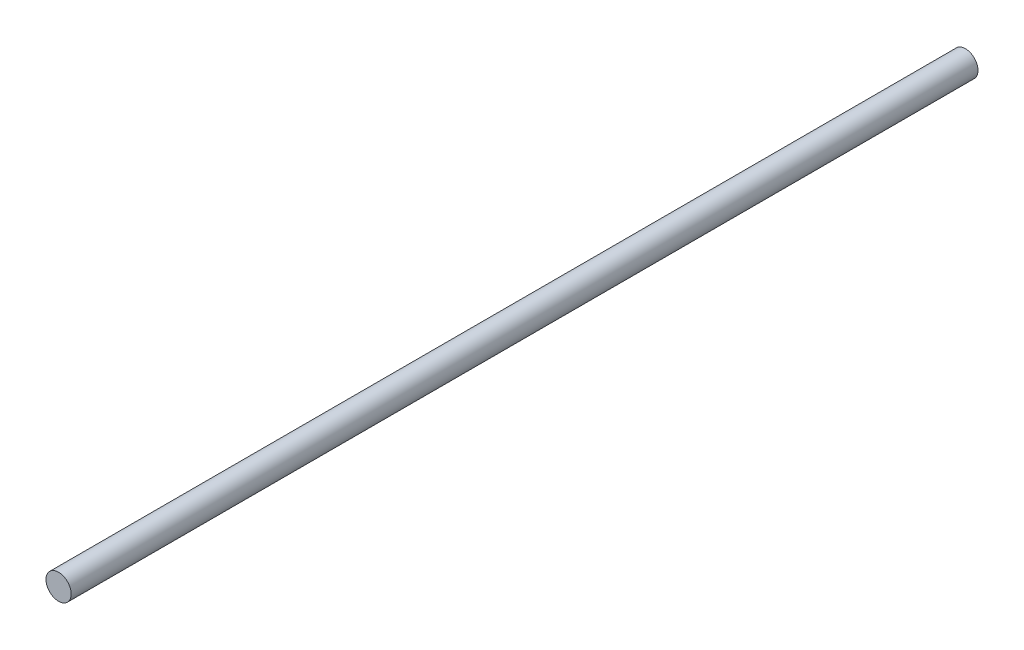
ISO-10303-21;
HEADER;
FILE_DESCRIPTION(('STEP AP214'),'2;1');
FILE_NAME('part.step','',(''),(''),'','','');
FILE_SCHEMA(('AUTOMOTIVE_DESIGN { 1 0 10303 214 1 1 1 1 }'));
ENDSEC;
DATA;
#1=APPLICATION_CONTEXT('core data for automotive mechanical design processes');
#2=APPLICATION_PROTOCOL_DEFINITION('international standard','automotive_design',2000,#1);
#3=PRODUCT_CONTEXT('',#1,'mechanical');
#4=PRODUCT('Part','Part','',(#3));
#5=PRODUCT_RELATED_PRODUCT_CATEGORY('part','',(#4));
#6=PRODUCT_DEFINITION_FORMATION('','',#4);
#7=PRODUCT_DEFINITION_CONTEXT('part definition',#1,'design');
#8=PRODUCT_DEFINITION('design','',#6,#7);
#9=PRODUCT_DEFINITION_SHAPE('','',#8);
#10=(LENGTH_UNIT() NAMED_UNIT(*) SI_UNIT(.MILLI.,.METRE.));
#11=(NAMED_UNIT(*) PLANE_ANGLE_UNIT() SI_UNIT($,.RADIAN.));
#12=(NAMED_UNIT(*) SI_UNIT($,.STERADIAN.) SOLID_ANGLE_UNIT());
#13=UNCERTAINTY_MEASURE_WITH_UNIT(LENGTH_MEASURE(1.E-05),#10,'distance_accuracy_value','');
#14=(GEOMETRIC_REPRESENTATION_CONTEXT(3) GLOBAL_UNCERTAINTY_ASSIGNED_CONTEXT((#13)) GLOBAL_UNIT_ASSIGNED_CONTEXT((#10,
#11,#12)) REPRESENTATION_CONTEXT('',''));
#15=CARTESIAN_POINT('',(0.,0.,0.));
#16=DIRECTION('',(0.,0.,1.));
#17=DIRECTION('',(1.,0.,0.));
#18=AXIS2_PLACEMENT_3D('',#15,#16,#17);
#19=CARTESIAN_POINT('',(0.,0.,114.3));
#20=DIRECTION('',(0.,0.,-1.));
#21=DIRECTION('',(-1.,0.,0.));
#22=AXIS2_PLACEMENT_3D('',#19,#20,#21);
#23=CYLINDRICAL_SURFACE('',#22,3.175);
#24=CARTESIAN_POINT('',(0.,0.,114.3));
#25=DIRECTION('',(0.,0.,1.));
#26=DIRECTION('',(1.,0.,0.));
#27=AXIS2_PLACEMENT_3D('',#24,#25,#26);
#28=CIRCLE('',#27,3.175);
#29=CARTESIAN_POINT('',(3.175,0.,114.3));
#30=VERTEX_POINT('',#29);
#31=EDGE_CURVE('E10',#30,#30,#28,.T.);
#32=ORIENTED_EDGE('',*,*,#31,.F.);
#33=EDGE_LOOP('',(#32));
#34=FACE_BOUND('',#33,.T.);
#35=CARTESIAN_POINT('',(0.,0.,-114.3));
#36=DIRECTION('',(0.,0.,1.));
#37=DIRECTION('',(1.,0.,0.));
#38=AXIS2_PLACEMENT_3D('',#35,#36,#37);
#39=CIRCLE('',#38,3.175);
#40=CARTESIAN_POINT('',(3.175,0.,-114.3));
#41=VERTEX_POINT('',#40);
#42=EDGE_CURVE('E31',#41,#41,#39,.T.);
#43=ORIENTED_EDGE('',*,*,#42,.T.);
#44=EDGE_LOOP('',(#43));
#45=FACE_BOUND('',#44,.T.);
#46=ADVANCED_FACE('F28',(#34,#45),#23,.T.);
#47=CARTESIAN_POINT('',(0.,0.,114.3));
#48=DIRECTION('',(0.,0.,1.));
#49=DIRECTION('',(1.,0.,0.));
#50=AXIS2_PLACEMENT_3D('',#47,#48,#49);
#51=PLANE('',#50);
#52=ORIENTED_EDGE('',*,*,#31,.T.);
#53=EDGE_LOOP('',(#52));
#54=FACE_BOUND('',#53,.T.);
#55=ADVANCED_FACE('F43',(#54),#51,.T.);
#56=CARTESIAN_POINT('',(0.,0.,-114.3));
#57=DIRECTION('',(0.,0.,1.));
#58=DIRECTION('',(1.,0.,0.));
#59=AXIS2_PLACEMENT_3D('',#56,#57,#58);
#60=PLANE('',#59);
#61=ORIENTED_EDGE('',*,*,#42,.F.);
#62=EDGE_LOOP('',(#61));
#63=FACE_BOUND('',#62,.T.);
#64=ADVANCED_FACE('F41',(#63),#60,.F.);
#65=CLOSED_SHELL('',(#46,#55,#64));
#66=MANIFOLD_SOLID_BREP('B2',#65);
#67=ADVANCED_BREP_SHAPE_REPRESENTATION('',(#18,#66),#14);
#68=SHAPE_DEFINITION_REPRESENTATION(#9,#67);
ENDSEC;
END-ISO-10303-21;
